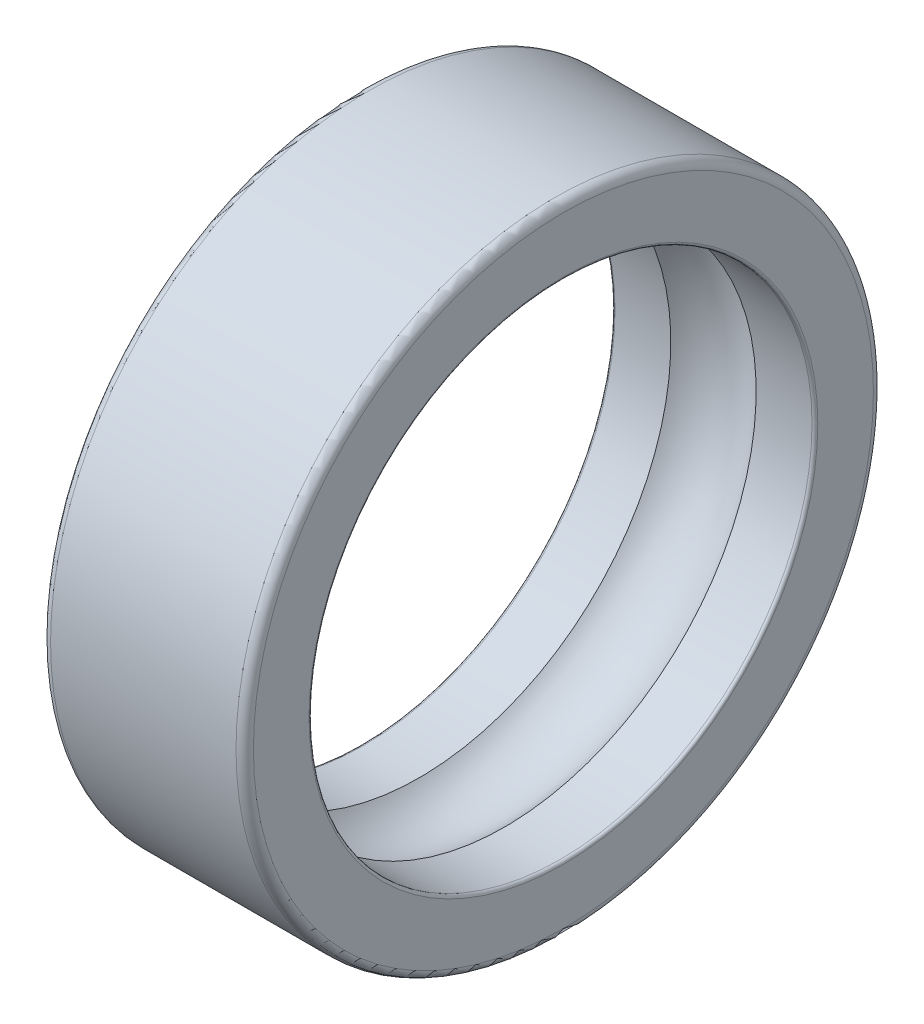
ISO-10303-21;
HEADER;
FILE_DESCRIPTION(('STEP AP214'),'2;1');
FILE_NAME('part.step','',(''),(''),'','','');
FILE_SCHEMA(('AUTOMOTIVE_DESIGN { 1 0 10303 214 1 1 1 1 }'));
ENDSEC;
DATA;
#1=APPLICATION_CONTEXT('core data for automotive mechanical design processes');
#2=APPLICATION_PROTOCOL_DEFINITION('international standard','automotive_design',2000,#1);
#3=PRODUCT_CONTEXT('',#1,'mechanical');
#4=PRODUCT('Part','Part','',(#3));
#5=PRODUCT_RELATED_PRODUCT_CATEGORY('part','',(#4));
#6=PRODUCT_DEFINITION_FORMATION('','',#4);
#7=PRODUCT_DEFINITION_CONTEXT('part definition',#1,'design');
#8=PRODUCT_DEFINITION('design','',#6,#7);
#9=PRODUCT_DEFINITION_SHAPE('','',#8);
#10=(LENGTH_UNIT() NAMED_UNIT(*) SI_UNIT(.MILLI.,.METRE.));
#11=(NAMED_UNIT(*) PLANE_ANGLE_UNIT() SI_UNIT($,.RADIAN.));
#12=(NAMED_UNIT(*) SI_UNIT($,.STERADIAN.) SOLID_ANGLE_UNIT());
#13=UNCERTAINTY_MEASURE_WITH_UNIT(LENGTH_MEASURE(1.E-05),#10,'distance_accuracy_value','');
#14=(GEOMETRIC_REPRESENTATION_CONTEXT(3) GLOBAL_UNCERTAINTY_ASSIGNED_CONTEXT((#13)) GLOBAL_UNIT_ASSIGNED_CONTEXT((#10,
#11,#12)) REPRESENTATION_CONTEXT('',''));
#15=CARTESIAN_POINT('',(0.,0.,0.));
#16=DIRECTION('',(0.,0.,1.));
#17=DIRECTION('',(1.,0.,0.));
#18=AXIS2_PLACEMENT_3D('',#15,#16,#17);
#19=CARTESIAN_POINT('',(3.5,0.,0.));
#20=DIRECTION('',(1.,0.,0.));
#21=DIRECTION('',(0.,1.,0.));
#22=AXIS2_PLACEMENT_3D('',#19,#20,#21);
#23=TOROIDAL_SURFACE('',#22,7.35,1.9845);
#24=CARTESIAN_POINT('',(4.9728680355008,0.,0.));
#25=DIRECTION('',(-1.,0.,0.));
#26=DIRECTION('',(0.,0.,1.));
#27=AXIS2_PLACEMENT_3D('',#24,#25,#26);
#28=CIRCLE('',#27,8.68);
#29=CARTESIAN_POINT('',(4.9728680355008,0.,8.68));
#30=VERTEX_POINT('',#29);
#31=EDGE_CURVE('E216',#30,#30,#28,.F.);
#32=ORIENTED_EDGE('',*,*,#31,.T.);
#33=EDGE_LOOP('',(#32));
#34=FACE_BOUND('',#33,.T.);
#35=CARTESIAN_POINT('',(2.0271319644992,0.,0.));
#36=DIRECTION('',(-1.,0.,0.));
#37=DIRECTION('',(0.,0.,1.));
#38=AXIS2_PLACEMENT_3D('',#35,#36,#37);
#39=CIRCLE('',#38,8.68);
#40=CARTESIAN_POINT('',(2.0271319644992,0.,8.68));
#41=VERTEX_POINT('',#40);
#42=EDGE_CURVE('E218',#41,#41,#39,.T.);
#43=ORIENTED_EDGE('',*,*,#42,.T.);
#44=EDGE_LOOP('',(#43));
#45=FACE_BOUND('',#44,.T.);
#46=ADVANCED_FACE('F17',(#34,#45),#23,.F.);
#47=CARTESIAN_POINT('',(50.,0.,0.));
#48=DIRECTION('',(-1.,0.,0.));
#49=DIRECTION('',(0.,0.,1.));
#50=AXIS2_PLACEMENT_3D('',#47,#48,#49);
#51=CYLINDRICAL_SURFACE('',#50,8.68);
#52=CARTESIAN_POINT('',(6.9,0.,0.));
#53=DIRECTION('',(1.,0.,0.));
#54=DIRECTION('',(0.,1.,0.));
#55=AXIS2_PLACEMENT_3D('',#52,#53,#54);
#56=CIRCLE('',#55,8.68);
#57=CARTESIAN_POINT('',(6.9,8.68,0.));
#58=VERTEX_POINT('',#57);
#59=EDGE_CURVE('E223',#58,#58,#56,.F.);
#60=ORIENTED_EDGE('',*,*,#59,.F.);
#61=EDGE_LOOP('',(#60));
#62=FACE_BOUND('',#61,.T.);
#63=ORIENTED_EDGE('',*,*,#31,.F.);
#64=EDGE_LOOP('',(#63));
#65=FACE_BOUND('',#64,.T.);
#66=ADVANCED_FACE('F250',(#62,#65),#51,.F.);
#67=CARTESIAN_POINT('',(50.,0.,0.));
#68=DIRECTION('',(-1.,0.,0.));
#69=DIRECTION('',(0.,0.,1.));
#70=AXIS2_PLACEMENT_3D('',#67,#68,#69);
#71=CYLINDRICAL_SURFACE('',#70,8.68);
#72=ORIENTED_EDGE('',*,*,#42,.F.);
#73=EDGE_LOOP('',(#72));
#74=FACE_BOUND('',#73,.T.);
#75=CARTESIAN_POINT('',(0.100000000000003,0.,0.));
#76=DIRECTION('',(1.,0.,0.));
#77=DIRECTION('',(0.,1.,0.));
#78=AXIS2_PLACEMENT_3D('',#75,#76,#77);
#79=CIRCLE('',#78,8.68);
#80=CARTESIAN_POINT('',(0.100000000000003,8.68,0.));
#81=VERTEX_POINT('',#80);
#82=EDGE_CURVE('E68',#81,#81,#79,.T.);
#83=ORIENTED_EDGE('',*,*,#82,.F.);
#84=EDGE_LOOP('',(#83));
#85=FACE_BOUND('',#84,.T.);
#86=ADVANCED_FACE('F237',(#74,#85),#71,.F.);
#87=CARTESIAN_POINT('',(6.90000000000016,0.,0.));
#88=DIRECTION('',(1.,0.,0.));
#89=DIRECTION('',(0.,1.,0.));
#90=AXIS2_PLACEMENT_3D('',#87,#88,#89);
#91=TOROIDAL_SURFACE('',#90,8.78,0.1);
#92=ORIENTED_EDGE('',*,*,#59,.T.);
#93=EDGE_LOOP('',(#92));
#94=FACE_BOUND('',#93,.T.);
#95=CARTESIAN_POINT('',(7.00000000000016,0.,0.));
#96=DIRECTION('',(1.,0.,0.));
#97=DIRECTION('',(0.,0.,1.));
#98=AXIS2_PLACEMENT_3D('',#95,#96,#97);
#99=CIRCLE('',#98,8.78);
#100=CARTESIAN_POINT('',(7.0000000000001,0.,-8.78));
#101=VERTEX_POINT('',#100);
#102=CARTESIAN_POINT('',(7.0000000000001,0.,8.78));
#103=VERTEX_POINT('',#102);
#104=EDGE_CURVE('E57',#101,#103,#99,.F.);
#105=ORIENTED_EDGE('',*,*,#104,.F.);
#106=CARTESIAN_POINT('',(7.00000000000016,0.,0.));
#107=DIRECTION('',(1.,0.,0.));
#108=DIRECTION('',(0.,0.,-1.));
#109=AXIS2_PLACEMENT_3D('',#106,#107,#108);
#110=CIRCLE('',#109,8.78);
#111=EDGE_CURVE('E55',#103,#101,#110,.F.);
#112=ORIENTED_EDGE('',*,*,#111,.F.);
#113=EDGE_LOOP('',(#105,#112));
#114=FACE_BOUND('',#113,.T.);
#115=ADVANCED_FACE('F59',(#94,#114),#91,.T.);
#116=CARTESIAN_POINT('',(0.0999999999999203,0.,0.));
#117=DIRECTION('',(1.,0.,0.));
#118=DIRECTION('',(0.,1.,0.));
#119=AXIS2_PLACEMENT_3D('',#116,#117,#118);
#120=TOROIDAL_SURFACE('',#119,8.78,0.1);
#121=CARTESIAN_POINT('',(0.,0.,0.));
#122=DIRECTION('',(-1.,0.,0.));
#123=DIRECTION('',(0.,0.,1.));
#124=AXIS2_PLACEMENT_3D('',#121,#122,#123);
#125=CIRCLE('',#124,8.78);
#126=CARTESIAN_POINT('',(0.,0.,-8.78));
#127=VERTEX_POINT('',#126);
#128=CARTESIAN_POINT('',(0.,0.,8.78));
#129=VERTEX_POINT('',#128);
#130=EDGE_CURVE('E62',#127,#129,#125,.F.);
#131=ORIENTED_EDGE('',*,*,#130,.F.);
#132=CARTESIAN_POINT('',(0.,0.,0.));
#133=DIRECTION('',(-1.,0.,0.));
#134=DIRECTION('',(0.,0.,-1.));
#135=AXIS2_PLACEMENT_3D('',#132,#133,#134);
#136=CIRCLE('',#135,8.78);
#137=EDGE_CURVE('E151',#129,#127,#136,.F.);
#138=ORIENTED_EDGE('',*,*,#137,.F.);
#139=EDGE_LOOP('',(#131,#138));
#140=FACE_BOUND('',#139,.T.);
#141=ORIENTED_EDGE('',*,*,#82,.T.);
#142=EDGE_LOOP('',(#141));
#143=FACE_BOUND('',#142,.T.);
#144=ADVANCED_FACE('F88',(#140,#143),#120,.T.);
#145=CARTESIAN_POINT('',(7.,8.78,0.));
#146=DIRECTION('',(1.,0.,0.));
#147=DIRECTION('',(0.,0.,-1.));
#148=AXIS2_PLACEMENT_3D('',#145,#146,#147);
#149=PLANE('',#148);
#150=ORIENTED_EDGE('',*,*,#111,.T.);
#151=ORIENTED_EDGE('',*,*,#104,.T.);
#152=EDGE_LOOP('',(#150,#151));
#153=FACE_BOUND('',#152,.T.);
#154=CARTESIAN_POINT('',(7.00000000000013,0.,0.));
#155=DIRECTION('',(-1.,0.,0.));
#156=DIRECTION('',(0.,0.,1.));
#157=AXIS2_PLACEMENT_3D('',#154,#155,#156);
#158=CIRCLE('',#157,10.7);
#159=CARTESIAN_POINT('',(7.00000000000008,0.,10.7));
#160=VERTEX_POINT('',#159);
#161=CARTESIAN_POINT('',(7.00000000000008,0.,-10.7));
#162=VERTEX_POINT('',#161);
#163=EDGE_CURVE('E113',#160,#162,#158,.T.);
#164=ORIENTED_EDGE('',*,*,#163,.F.);
#165=CARTESIAN_POINT('',(7.00000000000013,0.,0.));
#166=DIRECTION('',(-1.,0.,0.));
#167=DIRECTION('',(0.,0.,-1.));
#168=AXIS2_PLACEMENT_3D('',#165,#166,#167);
#169=CIRCLE('',#168,10.7);
#170=EDGE_CURVE('E188',#162,#160,#169,.T.);
#171=ORIENTED_EDGE('',*,*,#170,.F.);
#172=EDGE_LOOP('',(#164,#171));
#173=FACE_BOUND('',#172,.T.);
#174=ADVANCED_FACE('F66',(#153,#173),#149,.T.);
#175=CARTESIAN_POINT('',(0.,10.7,0.));
#176=DIRECTION('',(-1.,0.,0.));
#177=DIRECTION('',(0.,0.,1.));
#178=AXIS2_PLACEMENT_3D('',#175,#176,#177);
#179=PLANE('',#178);
#180=CARTESIAN_POINT('',(0.,0.,0.));
#181=DIRECTION('',(1.,0.,0.));
#182=DIRECTION('',(0.,0.,-1.));
#183=AXIS2_PLACEMENT_3D('',#180,#181,#182);
#184=CIRCLE('',#183,10.7);
#185=CARTESIAN_POINT('',(0.,0.,-10.7));
#186=VERTEX_POINT('',#185);
#187=CARTESIAN_POINT('',(0.,0.,10.7));
#188=VERTEX_POINT('',#187);
#189=EDGE_CURVE('E161',#186,#188,#184,.T.);
#190=ORIENTED_EDGE('',*,*,#189,.F.);
#191=CARTESIAN_POINT('',(0.,0.,0.));
#192=DIRECTION('',(1.,0.,0.));
#193=DIRECTION('',(0.,0.,1.));
#194=AXIS2_PLACEMENT_3D('',#191,#192,#193);
#195=CIRCLE('',#194,10.7);
#196=EDGE_CURVE('E37',#188,#186,#195,.T.);
#197=ORIENTED_EDGE('',*,*,#196,.F.);
#198=EDGE_LOOP('',(#190,#197));
#199=FACE_BOUND('',#198,.T.);
#200=ORIENTED_EDGE('',*,*,#130,.T.);
#201=ORIENTED_EDGE('',*,*,#137,.T.);
#202=EDGE_LOOP('',(#200,#201));
#203=FACE_BOUND('',#202,.T.);
#204=ADVANCED_FACE('F87',(#199,#203),#179,.T.);
#205=CARTESIAN_POINT('',(6.70000000000013,0.,0.));
#206=DIRECTION('',(1.,0.,0.));
#207=DIRECTION('',(0.,-1.,0.));
#208=AXIS2_PLACEMENT_3D('',#205,#206,#207);
#209=TOROIDAL_SURFACE('',#208,10.7,0.3);
#210=CARTESIAN_POINT('',(6.70000000000013,0.,0.));
#211=DIRECTION('',(-1.,0.,0.));
#212=DIRECTION('',(0.,0.,1.));
#213=AXIS2_PLACEMENT_3D('',#210,#211,#212);
#214=CIRCLE('',#213,11.);
#215=CARTESIAN_POINT('',(6.70000000000013,0.,11.));
#216=VERTEX_POINT('',#215);
#217=EDGE_CURVE('E29',#216,#216,#214,.T.);
#218=ORIENTED_EDGE('',*,*,#217,.F.);
#219=EDGE_LOOP('',(#218));
#220=FACE_BOUND('',#219,.T.);
#221=ORIENTED_EDGE('',*,*,#163,.T.);
#222=ORIENTED_EDGE('',*,*,#170,.T.);
#223=EDGE_LOOP('',(#221,#222));
#224=FACE_BOUND('',#223,.T.);
#225=ADVANCED_FACE('F118',(#220,#224),#209,.T.);
#226=CARTESIAN_POINT('',(0.299999999999936,0.,0.));
#227=DIRECTION('',(1.,0.,0.));
#228=DIRECTION('',(0.,-1.,0.));
#229=AXIS2_PLACEMENT_3D('',#226,#227,#228);
#230=TOROIDAL_SURFACE('',#229,10.7,0.3);
#231=ORIENTED_EDGE('',*,*,#196,.T.);
#232=ORIENTED_EDGE('',*,*,#189,.T.);
#233=EDGE_LOOP('',(#231,#232));
#234=FACE_BOUND('',#233,.T.);
#235=CARTESIAN_POINT('',(0.300000000000002,0.,0.));
#236=DIRECTION('',(-1.,0.,0.));
#237=DIRECTION('',(0.,0.,1.));
#238=AXIS2_PLACEMENT_3D('',#235,#236,#237);
#239=CIRCLE('',#238,11.);
#240=CARTESIAN_POINT('',(0.300000000000002,0.,11.));
#241=VERTEX_POINT('',#240);
#242=EDGE_CURVE('E11',#241,#241,#239,.F.);
#243=ORIENTED_EDGE('',*,*,#242,.F.);
#244=EDGE_LOOP('',(#243));
#245=FACE_BOUND('',#244,.T.);
#246=ADVANCED_FACE('F128',(#234,#245),#230,.T.);
#247=CARTESIAN_POINT('',(50.,0.,0.));
#248=DIRECTION('',(-1.,0.,0.));
#249=DIRECTION('',(0.,0.,1.));
#250=AXIS2_PLACEMENT_3D('',#247,#248,#249);
#251=CYLINDRICAL_SURFACE('',#250,11.);
#252=ORIENTED_EDGE('',*,*,#242,.T.);
#253=EDGE_LOOP('',(#252));
#254=FACE_BOUND('',#253,.T.);
#255=ORIENTED_EDGE('',*,*,#217,.T.);
#256=EDGE_LOOP('',(#255));
#257=FACE_BOUND('',#256,.T.);
#258=ADVANCED_FACE('F261',(#254,#257),#251,.T.);
#259=CLOSED_SHELL('',(#46,#66,#86,#115,#144,#174,#204,#225,#246,#258));
#260=MANIFOLD_SOLID_BREP('B1',#259);
#261=ADVANCED_BREP_SHAPE_REPRESENTATION('',(#18,#260),#14);
#262=SHAPE_DEFINITION_REPRESENTATION(#9,#261);
ENDSEC;
END-ISO-10303-21;
